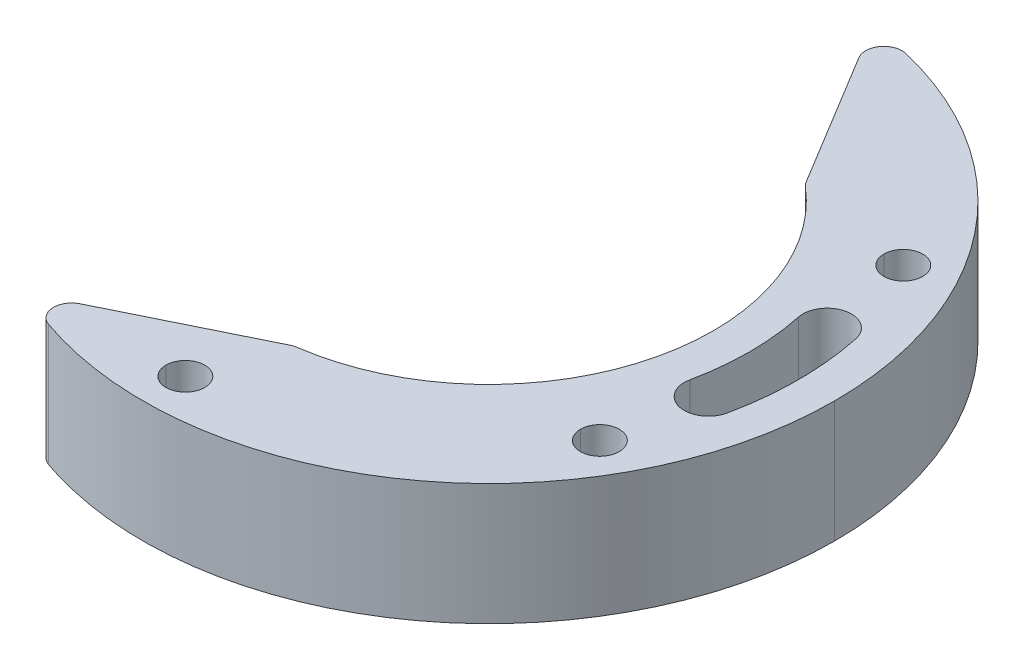
ISO-10303-21;
HEADER;
FILE_DESCRIPTION(('STEP AP214'),'2;1');
FILE_NAME('part.step','',(''),(''),'','','');
FILE_SCHEMA(('AUTOMOTIVE_DESIGN { 1 0 10303 214 1 1 1 1 }'));
ENDSEC;
DATA;
#1=APPLICATION_CONTEXT('core data for automotive mechanical design processes');
#2=APPLICATION_PROTOCOL_DEFINITION('international standard','automotive_design',2000,#1);
#3=PRODUCT_CONTEXT('',#1,'mechanical');
#4=PRODUCT('Part','Part','',(#3));
#5=PRODUCT_RELATED_PRODUCT_CATEGORY('part','',(#4));
#6=PRODUCT_DEFINITION_FORMATION('','',#4);
#7=PRODUCT_DEFINITION_CONTEXT('part definition',#1,'design');
#8=PRODUCT_DEFINITION('design','',#6,#7);
#9=PRODUCT_DEFINITION_SHAPE('','',#8);
#10=(LENGTH_UNIT() NAMED_UNIT(*) SI_UNIT(.MILLI.,.METRE.));
#11=(NAMED_UNIT(*) PLANE_ANGLE_UNIT() SI_UNIT($,.RADIAN.));
#12=(NAMED_UNIT(*) SI_UNIT($,.STERADIAN.) SOLID_ANGLE_UNIT());
#13=UNCERTAINTY_MEASURE_WITH_UNIT(LENGTH_MEASURE(1.E-05),#10,'distance_accuracy_value','');
#14=(GEOMETRIC_REPRESENTATION_CONTEXT(3) GLOBAL_UNCERTAINTY_ASSIGNED_CONTEXT((#13)) GLOBAL_UNIT_ASSIGNED_CONTEXT((#10,
#11,#12)) REPRESENTATION_CONTEXT('',''));
#15=CARTESIAN_POINT('',(0.,0.,0.));
#16=DIRECTION('',(0.,0.,1.));
#17=DIRECTION('',(1.,0.,0.));
#18=AXIS2_PLACEMENT_3D('',#15,#16,#17);
#19=CARTESIAN_POINT('',(0.,-5.,0.));
#20=DIRECTION('',(0.,-1.,0.));
#21=DIRECTION('',(1.,0.,0.));
#22=AXIS2_PLACEMENT_3D('',#19,#20,#21);
#23=PLANE('',#22);
#24=CARTESIAN_POINT('',(22.9864686172444,-4.99999999999991,-4.88592473421735));
#25=DIRECTION('',(0.,-1.,0.));
#26=DIRECTION('',(0.,0.,-1.));
#27=AXIS2_PLACEMENT_3D('',#24,#25,#26);
#28=CIRCLE('',#27,2.);
#29=CARTESIAN_POINT('',(21.0301734157768,-5.,-4.47010135258184));
#30=VERTEX_POINT('',#29);
#31=CARTESIAN_POINT('',(24.942763818712,-5.,-5.30174811585288));
#32=VERTEX_POINT('',#31);
#33=EDGE_CURVE('E229',#30,#32,#28,.T.);
#34=ORIENTED_EDGE('',*,*,#33,.F.);
#35=CARTESIAN_POINT('',(0.,-5.,0.));
#36=DIRECTION('',(0.,-1.,0.));
#37=DIRECTION('',(0.,0.,-1.));
#38=AXIS2_PLACEMENT_3D('',#35,#36,#37);
#39=CIRCLE('',#38,21.5);
#40=CARTESIAN_POINT('',(21.0301734157768,-5.,4.47010135258184));
#41=VERTEX_POINT('',#40);
#42=EDGE_CURVE('E233',#30,#41,#39,.T.);
#43=ORIENTED_EDGE('',*,*,#42,.T.);
#44=CARTESIAN_POINT('',(22.9864686172444,-5.,4.88592473421736));
#45=DIRECTION('',(0.,-1.,0.));
#46=DIRECTION('',(0.,0.,-1.));
#47=AXIS2_PLACEMENT_3D('',#44,#45,#46);
#48=CIRCLE('',#47,2.);
#49=CARTESIAN_POINT('',(24.942763818712,-4.99999999999991,5.30174811585287));
#50=VERTEX_POINT('',#49);
#51=EDGE_CURVE('E236',#50,#41,#48,.T.);
#52=ORIENTED_EDGE('',*,*,#51,.F.);
#53=CARTESIAN_POINT('',(0.,-5.,0.));
#54=DIRECTION('',(0.,-1.,0.));
#55=DIRECTION('',(0.,0.,-1.));
#56=AXIS2_PLACEMENT_3D('',#53,#54,#55);
#57=CIRCLE('',#56,25.5);
#58=EDGE_CURVE('E240',#32,#50,#57,.T.);
#59=ORIENTED_EDGE('',*,*,#58,.F.);
#60=EDGE_LOOP('',(#34,#43,#52,#59));
#61=FACE_BOUND('',#60,.T.);
#62=CARTESIAN_POINT('',(21.650635094611,-5.,-12.5));
#63=DIRECTION('',(0.,1.,0.));
#64=DIRECTION('',(-1.,0.,0.));
#65=AXIS2_PLACEMENT_3D('',#62,#63,#64);
#66=CIRCLE('',#65,2.75);
#67=CARTESIAN_POINT('',(18.900635094611,-4.99999999999999,-12.5));
#68=VERTEX_POINT('',#67);
#69=CARTESIAN_POINT('',(24.400635094611,-5.,-12.5));
#70=VERTEX_POINT('',#69);
#71=EDGE_CURVE('E349',#68,#70,#66,.T.);
#72=ORIENTED_EDGE('',*,*,#71,.T.);
#73=CARTESIAN_POINT('',(21.650635094611,-5.,-12.5));
#74=DIRECTION('',(0.,1.,0.));
#75=DIRECTION('',(1.,0.,0.));
#76=AXIS2_PLACEMENT_3D('',#73,#74,#75);
#77=CIRCLE('',#76,2.75);
#78=EDGE_CURVE('E346',#70,#68,#77,.T.);
#79=ORIENTED_EDGE('',*,*,#78,.T.);
#80=EDGE_LOOP('',(#72,#79));
#81=FACE_BOUND('',#80,.T.);
#82=CARTESIAN_POINT('',(21.650635094611,-5.,12.5));
#83=DIRECTION('',(0.,1.,0.));
#84=DIRECTION('',(-1.,0.,0.));
#85=AXIS2_PLACEMENT_3D('',#82,#83,#84);
#86=CIRCLE('',#85,2.75);
#87=CARTESIAN_POINT('',(18.900635094611,-5.00000000000001,12.5));
#88=VERTEX_POINT('',#87);
#89=CARTESIAN_POINT('',(24.400635094611,-5.,12.5));
#90=VERTEX_POINT('',#89);
#91=EDGE_CURVE('E343',#88,#90,#86,.T.);
#92=ORIENTED_EDGE('',*,*,#91,.T.);
#93=CARTESIAN_POINT('',(21.650635094611,-5.,12.5));
#94=DIRECTION('',(0.,1.,0.));
#95=DIRECTION('',(1.,0.,0.));
#96=AXIS2_PLACEMENT_3D('',#93,#94,#95);
#97=CIRCLE('',#96,2.75);
#98=EDGE_CURVE('E340',#90,#88,#97,.T.);
#99=ORIENTED_EDGE('',*,*,#98,.T.);
#100=EDGE_LOOP('',(#92,#99));
#101=FACE_BOUND('',#100,.T.);
#102=CARTESIAN_POINT('',(0.,-5.,25.));
#103=DIRECTION('',(0.,1.,0.));
#104=DIRECTION('',(-1.,0.,0.));
#105=AXIS2_PLACEMENT_3D('',#102,#103,#104);
#106=CIRCLE('',#105,2.75);
#107=CARTESIAN_POINT('',(-2.75,-5.,25.));
#108=VERTEX_POINT('',#107);
#109=CARTESIAN_POINT('',(2.75000000000001,-5.,25.));
#110=VERTEX_POINT('',#109);
#111=EDGE_CURVE('E337',#108,#110,#106,.T.);
#112=ORIENTED_EDGE('',*,*,#111,.T.);
#113=CARTESIAN_POINT('',(0.,-5.,25.));
#114=DIRECTION('',(0.,1.,0.));
#115=DIRECTION('',(1.,0.,0.));
#116=AXIS2_PLACEMENT_3D('',#113,#114,#115);
#117=CIRCLE('',#116,2.75);
#118=EDGE_CURVE('E334',#110,#108,#117,.T.);
#119=ORIENTED_EDGE('',*,*,#118,.T.);
#120=EDGE_LOOP('',(#112,#119));
#121=FACE_BOUND('',#120,.T.);
#122=CARTESIAN_POINT('',(0.,-5.,0.));
#123=DIRECTION('',(0.,-1.,0.));
#124=DIRECTION('',(1.,0.,0.));
#125=AXIS2_PLACEMENT_3D('',#122,#123,#124);
#126=CIRCLE('',#125,28.5);
#127=CARTESIAN_POINT('',(28.5,-5.,0.));
#128=VERTEX_POINT('',#127);
#129=CARTESIAN_POINT('',(-6.64347695413615,-4.99999999999991,27.7148735151337));
#130=VERTEX_POINT('',#129);
#131=EDGE_CURVE('E331',#128,#130,#126,.T.);
#132=ORIENTED_EDGE('',*,*,#131,.T.);
#133=CARTESIAN_POINT('',(0.,-5.,0.));
#134=DIRECTION('',(0.,-1.,0.));
#135=DIRECTION('',(-0.233104454531094,0.,0.972451702285393));
#136=AXIS2_PLACEMENT_3D('',#133,#134,#135);
#137=CIRCLE('',#136,28.5);
#138=CARTESIAN_POINT('',(-9.34455007267333,-5.,26.9245126964129));
#139=VERTEX_POINT('',#138);
#140=EDGE_CURVE('E328',#130,#139,#137,.T.);
#141=ORIENTED_EDGE('',*,*,#140,.T.);
#142=CARTESIAN_POINT('',(-8.85273164779584,-5.00000000000001,25.5074330808122));
#143=DIRECTION('',(0.,-1.,0.));
#144=DIRECTION('',(-0.327878949918248,0.,0.944719743733825));
#145=AXIS2_PLACEMENT_3D('',#142,#143,#144);
#146=CIRCLE('',#145,1.5);
#147=CARTESIAN_POINT('',(-9.51346314014746,-5.,24.1607950837934));
#148=VERTEX_POINT('',#147);
#149=EDGE_CURVE('E325',#139,#148,#146,.T.);
#150=ORIENTED_EDGE('',*,*,#149,.T.);
#151=DIRECTION('',(0.897758664679207,0.,-0.44048766156773));
#152=VECTOR('',#151,1.);
#153=CARTESIAN_POINT('',(-9.51346314014751,-5.,24.1607950837934));
#154=LINE('',#153,#152);
#155=CARTESIAN_POINT('',(2.10203301346869,-5.,18.4616211966958));
#156=VERTEX_POINT('',#155);
#157=EDGE_CURVE('E322',#148,#156,#154,.T.);
#158=ORIENTED_EDGE('',*,*,#157,.T.);
#159=CARTESIAN_POINT('',(2.76276450582039,-5.0000000000001,19.8082591937146));
#160=DIRECTION('',(0.,-1.,0.));
#161=DIRECTION('',(-0.440487661567936,0.,-0.897758664679106));
#162=AXIS2_PLACEMENT_3D('',#159,#160,#161);
#163=CIRCLE('',#162,1.5);
#164=CARTESIAN_POINT('',(2.55555716788384,-5.,18.322639754186));
#165=VERTEX_POINT('',#164);
#166=EDGE_CURVE('E319',#156,#165,#163,.T.);
#167=ORIENTED_EDGE('',*,*,#166,.T.);
#168=CARTESIAN_POINT('',(0.,-5.,0.));
#169=DIRECTION('',(0.,1.,0.));
#170=DIRECTION('',(0.138138225291018,0.,0.99041295968573));
#171=AXIS2_PLACEMENT_3D('',#168,#169,#170);
#172=CIRCLE('',#171,18.5);
#173=CARTESIAN_POINT('',(18.5,-5.,0.));
#174=VERTEX_POINT('',#173);
#175=EDGE_CURVE('E316',#165,#174,#172,.T.);
#176=ORIENTED_EDGE('',*,*,#175,.T.);
#177=CARTESIAN_POINT('',(0.,-5.,0.));
#178=DIRECTION('',(0.,1.,0.));
#179=DIRECTION('',(1.,0.,0.));
#180=AXIS2_PLACEMENT_3D('',#177,#178,#179);
#181=CIRCLE('',#180,18.5);
#182=CARTESIAN_POINT('',(12.0295450818391,-5.,-14.0548939919161));
#183=VERTEX_POINT('',#182);
#184=EDGE_CURVE('E313',#174,#183,#181,.T.);
#185=ORIENTED_EDGE('',*,*,#184,.T.);
#186=CARTESIAN_POINT('',(13.0049136019881,-5.,-15.1944799912608));
#187=DIRECTION('',(0.,-1.,0.));
#188=DIRECTION('',(-0.650245680099214,0.,0.759723999563204));
#189=AXIS2_PLACEMENT_3D('',#186,#187,#188);
#190=CIRCLE('',#189,1.5);
#191=CARTESIAN_POINT('',(11.722477893601,-5.,-14.4164320146851));
#192=VERTEX_POINT('',#191);
#193=EDGE_CURVE('E310',#183,#192,#190,.T.);
#194=ORIENTED_EDGE('',*,*,#193,.T.);
#195=DIRECTION('',(-0.518698651050486,0.,-0.854957138924756));
#196=VECTOR('',#195,1.);
#197=CARTESIAN_POINT('',(11.7224778936009,-5.,-14.4164320146851));
#198=LINE('',#197,#196);
#199=CARTESIAN_POINT('',(5.01138456395243,-5.,-25.4781479851299));
#200=VERTEX_POINT('',#199);
#201=EDGE_CURVE('E304',#192,#200,#198,.T.);
#202=ORIENTED_EDGE('',*,*,#201,.T.);
#203=CARTESIAN_POINT('',(6.29382027233955,-5.,-26.2561959617056));
#204=DIRECTION('',(0.,-1.,0.));
#205=DIRECTION('',(-0.854957138924763,0.,0.518698651050473));
#206=AXIS2_PLACEMENT_3D('',#203,#204,#205);
#207=CIRCLE('',#206,1.5);
#208=CARTESIAN_POINT('',(6.64347695413626,-5.,-27.7148735151337));
#209=VERTEX_POINT('',#208);
#210=EDGE_CURVE('E257',#200,#209,#207,.T.);
#211=ORIENTED_EDGE('',*,*,#210,.T.);
#212=CARTESIAN_POINT('',(0.,-5.,0.));
#213=DIRECTION('',(0.,-1.,0.));
#214=DIRECTION('',(0.233104454531102,0.,-0.97245170228539));
#215=AXIS2_PLACEMENT_3D('',#212,#213,#214);
#216=CIRCLE('',#215,28.5);
#217=EDGE_CURVE('E266',#209,#128,#216,.T.);
#218=ORIENTED_EDGE('',*,*,#217,.T.);
#219=EDGE_LOOP('',(#132,#141,#150,#158,#167,#176,#185,#194,#202,#211,#218));
#220=FACE_BOUND('',#219,.T.);
#221=ADVANCED_FACE('F39',(#61,#81,#101,#121,#220),#23,.T.);
#222=CARTESIAN_POINT('',(0.,5.,0.));
#223=DIRECTION('',(0.,-1.,0.));
#224=DIRECTION('',(1.,0.,0.));
#225=AXIS2_PLACEMENT_3D('',#222,#223,#224);
#226=PLANE('',#225);
#227=CARTESIAN_POINT('',(13.0049136019881,5.,-15.1944799912608));
#228=DIRECTION('',(0.,1.,0.));
#229=DIRECTION('',(-0.854957138924803,0.,0.518698651050411));
#230=AXIS2_PLACEMENT_3D('',#227,#228,#229);
#231=CIRCLE('',#230,1.5);
#232=CARTESIAN_POINT('',(11.722477893601,5.,-14.4164320146851));
#233=VERTEX_POINT('',#232);
#234=CARTESIAN_POINT('',(12.0295450818391,5.,-14.0548939919162));
#235=VERTEX_POINT('',#234);
#236=EDGE_CURVE('E283',#233,#235,#231,.T.);
#237=ORIENTED_EDGE('',*,*,#236,.T.);
#238=CARTESIAN_POINT('',(0.,5.,0.));
#239=DIRECTION('',(0.,-1.,0.));
#240=DIRECTION('',(0.650245680099414,0.,-0.759723999563031));
#241=AXIS2_PLACEMENT_3D('',#238,#239,#240);
#242=CIRCLE('',#241,18.5);
#243=CARTESIAN_POINT('',(18.5,5.,0.));
#244=VERTEX_POINT('',#243);
#245=EDGE_CURVE('E280',#235,#244,#242,.T.);
#246=ORIENTED_EDGE('',*,*,#245,.T.);
#247=CARTESIAN_POINT('',(0.,5.,0.));
#248=DIRECTION('',(0.,-1.,0.));
#249=DIRECTION('',(1.,0.,0.));
#250=AXIS2_PLACEMENT_3D('',#247,#248,#249);
#251=CIRCLE('',#250,18.5);
#252=CARTESIAN_POINT('',(2.55555716788388,5.,18.322639754186));
#253=VERTEX_POINT('',#252);
#254=EDGE_CURVE('E277',#244,#253,#251,.T.);
#255=ORIENTED_EDGE('',*,*,#254,.T.);
#256=CARTESIAN_POINT('',(2.76276450582038,4.99999999999989,19.8082591937146));
#257=DIRECTION('',(0.,1.,0.));
#258=DIRECTION('',(-0.138138225290984,0.,-0.990412959685733));
#259=AXIS2_PLACEMENT_3D('',#256,#257,#258);
#260=CIRCLE('',#259,1.5);
#261=CARTESIAN_POINT('',(2.10203301346867,5.,18.4616211966958));
#262=VERTEX_POINT('',#261);
#263=EDGE_CURVE('E274',#253,#262,#260,.T.);
#264=ORIENTED_EDGE('',*,*,#263,.T.);
#265=DIRECTION('',(-0.897758664679207,0.,0.44048766156773));
#266=VECTOR('',#265,1.);
#267=CARTESIAN_POINT('',(2.10203301346844,5.,18.4616211966959));
#268=LINE('',#267,#266);
#269=CARTESIAN_POINT('',(-9.51346314014746,5.,24.1607950837934));
#270=VERTEX_POINT('',#269);
#271=EDGE_CURVE('E271',#262,#270,#268,.T.);
#272=ORIENTED_EDGE('',*,*,#271,.T.);
#273=CARTESIAN_POINT('',(-8.85273164779583,5.,25.5074330808122));
#274=DIRECTION('',(0.,1.,0.));
#275=DIRECTION('',(-0.440487661567778,0.,-0.897758664679182));
#276=AXIS2_PLACEMENT_3D('',#273,#274,#275);
#277=CIRCLE('',#276,1.5);
#278=CARTESIAN_POINT('',(-9.34455007267333,5.,26.9245126964129));
#279=VERTEX_POINT('',#278);
#280=EDGE_CURVE('E268',#270,#279,#277,.T.);
#281=ORIENTED_EDGE('',*,*,#280,.T.);
#282=CARTESIAN_POINT('',(0.,5.,0.));
#283=DIRECTION('',(0.,1.,0.));
#284=DIRECTION('',(-0.327878949918359,0.,0.944719743733787));
#285=AXIS2_PLACEMENT_3D('',#282,#283,#284);
#286=CIRCLE('',#285,28.5);
#287=CARTESIAN_POINT('',(28.5,5.,0.));
#288=VERTEX_POINT('',#287);
#289=EDGE_CURVE('E62',#279,#288,#286,.T.);
#290=ORIENTED_EDGE('',*,*,#289,.T.);
#291=CARTESIAN_POINT('',(0.,5.,0.));
#292=DIRECTION('',(0.,1.,0.));
#293=DIRECTION('',(1.,0.,0.));
#294=AXIS2_PLACEMENT_3D('',#291,#292,#293);
#295=CIRCLE('',#294,28.5);
#296=CARTESIAN_POINT('',(6.64347695413627,5.,-27.7148735151336));
#297=VERTEX_POINT('',#296);
#298=EDGE_CURVE('E264',#288,#297,#295,.T.);
#299=ORIENTED_EDGE('',*,*,#298,.T.);
#300=CARTESIAN_POINT('',(6.29382027233955,4.99999999999999,-26.2561959617056));
#301=DIRECTION('',(0.,1.,0.));
#302=DIRECTION('',(0.233104454531234,0.,-0.97245170228536));
#303=AXIS2_PLACEMENT_3D('',#300,#301,#302);
#304=CIRCLE('',#303,1.5);
#305=CARTESIAN_POINT('',(5.01138456395241,5.00000000000001,-25.4781479851299));
#306=VERTEX_POINT('',#305);
#307=EDGE_CURVE('E253',#297,#306,#304,.T.);
#308=ORIENTED_EDGE('',*,*,#307,.T.);
#309=DIRECTION('',(0.518698651050486,0.,0.854957138924756));
#310=VECTOR('',#309,1.);
#311=CARTESIAN_POINT('',(5.01138456395243,5.00000000000001,-25.4781479851298));
#312=LINE('',#311,#310);
#313=EDGE_CURVE('E258',#306,#233,#312,.T.);
#314=ORIENTED_EDGE('',*,*,#313,.T.);
#315=EDGE_LOOP('',(#237,#246,#255,#264,#272,#281,#290,#299,#308,#314));
#316=FACE_BOUND('',#315,.T.);
#317=CARTESIAN_POINT('',(21.650635094611,5.,-12.5));
#318=DIRECTION('',(0.,-1.,0.));
#319=DIRECTION('',(1.,0.,0.));
#320=AXIS2_PLACEMENT_3D('',#317,#318,#319);
#321=CIRCLE('',#320,1.6);
#322=CARTESIAN_POINT('',(23.250635094611,5.,-12.5));
#323=VERTEX_POINT('',#322);
#324=CARTESIAN_POINT('',(20.050635094611,5.,-12.5));
#325=VERTEX_POINT('',#324);
#326=EDGE_CURVE('E289',#323,#325,#321,.T.);
#327=ORIENTED_EDGE('',*,*,#326,.T.);
#328=CARTESIAN_POINT('',(21.650635094611,5.,-12.5));
#329=DIRECTION('',(0.,-1.,0.));
#330=DIRECTION('',(-1.,0.,0.));
#331=AXIS2_PLACEMENT_3D('',#328,#329,#330);
#332=CIRCLE('',#331,1.6);
#333=EDGE_CURVE('E286',#325,#323,#332,.T.);
#334=ORIENTED_EDGE('',*,*,#333,.T.);
#335=EDGE_LOOP('',(#327,#334));
#336=FACE_BOUND('',#335,.T.);
#337=CARTESIAN_POINT('',(21.650635094611,5.,12.5));
#338=DIRECTION('',(0.,-1.,0.));
#339=DIRECTION('',(1.,0.,0.));
#340=AXIS2_PLACEMENT_3D('',#337,#338,#339);
#341=CIRCLE('',#340,1.6);
#342=CARTESIAN_POINT('',(23.250635094611,5.0000000000001,12.5));
#343=VERTEX_POINT('',#342);
#344=CARTESIAN_POINT('',(20.050635094611,5.,12.5));
#345=VERTEX_POINT('',#344);
#346=EDGE_CURVE('E295',#343,#345,#341,.T.);
#347=ORIENTED_EDGE('',*,*,#346,.T.);
#348=CARTESIAN_POINT('',(21.650635094611,5.,12.5));
#349=DIRECTION('',(0.,-1.,0.));
#350=DIRECTION('',(-1.,0.,0.));
#351=AXIS2_PLACEMENT_3D('',#348,#349,#350);
#352=CIRCLE('',#351,1.6);
#353=EDGE_CURVE('E292',#345,#343,#352,.T.);
#354=ORIENTED_EDGE('',*,*,#353,.T.);
#355=EDGE_LOOP('',(#347,#354));
#356=FACE_BOUND('',#355,.T.);
#357=CARTESIAN_POINT('',(0.,5.,25.));
#358=DIRECTION('',(0.,-1.,0.));
#359=DIRECTION('',(1.,0.,0.));
#360=AXIS2_PLACEMENT_3D('',#357,#358,#359);
#361=CIRCLE('',#360,1.6);
#362=CARTESIAN_POINT('',(1.6,5.0000000000001,25.));
#363=VERTEX_POINT('',#362);
#364=CARTESIAN_POINT('',(-1.6,5.,25.));
#365=VERTEX_POINT('',#364);
#366=EDGE_CURVE('E301',#363,#365,#361,.T.);
#367=ORIENTED_EDGE('',*,*,#366,.T.);
#368=CARTESIAN_POINT('',(0.,5.,25.));
#369=DIRECTION('',(0.,-1.,0.));
#370=DIRECTION('',(-1.,0.,0.));
#371=AXIS2_PLACEMENT_3D('',#368,#369,#370);
#372=CIRCLE('',#371,1.6);
#373=EDGE_CURVE('E298',#365,#363,#372,.T.);
#374=ORIENTED_EDGE('',*,*,#373,.T.);
#375=EDGE_LOOP('',(#367,#374));
#376=FACE_BOUND('',#375,.T.);
#377=CARTESIAN_POINT('',(0.,5.,0.));
#378=DIRECTION('',(0.,-1.,0.));
#379=DIRECTION('',(0.,0.,-1.));
#380=AXIS2_PLACEMENT_3D('',#377,#378,#379);
#381=CIRCLE('',#380,21.5);
#382=CARTESIAN_POINT('',(21.0301734157768,5.,-4.47010135258183));
#383=VERTEX_POINT('',#382);
#384=CARTESIAN_POINT('',(21.0301734157768,5.,4.47010135258184));
#385=VERTEX_POINT('',#384);
#386=EDGE_CURVE('E11',#383,#385,#381,.T.);
#387=ORIENTED_EDGE('',*,*,#386,.F.);
#388=CARTESIAN_POINT('',(22.9864686172444,5.0000000000001,-4.88592473421737));
#389=DIRECTION('',(0.,-1.,0.));
#390=DIRECTION('',(0.,0.,-1.));
#391=AXIS2_PLACEMENT_3D('',#388,#389,#390);
#392=CIRCLE('',#391,2.);
#393=CARTESIAN_POINT('',(24.942763818712,5.,-5.30174811585287));
#394=VERTEX_POINT('',#393);
#395=EDGE_CURVE('E227',#383,#394,#392,.T.);
#396=ORIENTED_EDGE('',*,*,#395,.T.);
#397=CARTESIAN_POINT('',(0.,5.,0.));
#398=DIRECTION('',(0.,-1.,0.));
#399=DIRECTION('',(0.,0.,-1.));
#400=AXIS2_PLACEMENT_3D('',#397,#398,#399);
#401=CIRCLE('',#400,25.5);
#402=CARTESIAN_POINT('',(24.942763818712,5.0000000000001,5.30174811585287));
#403=VERTEX_POINT('',#402);
#404=EDGE_CURVE('E47',#394,#403,#401,.T.);
#405=ORIENTED_EDGE('',*,*,#404,.T.);
#406=CARTESIAN_POINT('',(22.9864686172444,5.,4.88592473421735));
#407=DIRECTION('',(0.,-1.,0.));
#408=DIRECTION('',(0.,0.,-1.));
#409=AXIS2_PLACEMENT_3D('',#406,#407,#408);
#410=CIRCLE('',#409,2.);
#411=EDGE_CURVE('E54',#403,#385,#410,.T.);
#412=ORIENTED_EDGE('',*,*,#411,.T.);
#413=EDGE_LOOP('',(#387,#396,#405,#412));
#414=FACE_BOUND('',#413,.T.);
#415=ADVANCED_FACE('F231',(#316,#336,#356,#376,#414),#226,.F.);
#416=CARTESIAN_POINT('',(21.650635094611,-5.,-12.5));
#417=DIRECTION('',(0.,-1.,0.));
#418=DIRECTION('',(1.,0.,0.));
#419=AXIS2_PLACEMENT_3D('',#416,#417,#418);
#420=CYLINDRICAL_SURFACE('',#419,1.6);
#421=ORIENTED_EDGE('',*,*,#326,.F.);
#422=DIRECTION('',(0.,-1.,0.));
#423=VECTOR('',#422,1.);
#424=CARTESIAN_POINT('',(23.250635094611,5.,-12.5));
#425=LINE('',#424,#423);
#426=CARTESIAN_POINT('',(23.250635094611,-2.,-12.5));
#427=VERTEX_POINT('',#426);
#428=EDGE_CURVE('E423',#323,#427,#425,.T.);
#429=ORIENTED_EDGE('',*,*,#428,.T.);
#430=CARTESIAN_POINT('',(21.650635094611,-2.,-12.5));
#431=DIRECTION('',(0.,1.,0.));
#432=DIRECTION('',(-1.,0.,0.));
#433=AXIS2_PLACEMENT_3D('',#430,#431,#432);
#434=CIRCLE('',#433,1.6);
#435=CARTESIAN_POINT('',(20.050635094611,-2.,-12.5));
#436=VERTEX_POINT('',#435);
#437=EDGE_CURVE('E420',#436,#427,#434,.T.);
#438=ORIENTED_EDGE('',*,*,#437,.F.);
#439=DIRECTION('',(0.,-1.,0.));
#440=VECTOR('',#439,1.);
#441=CARTESIAN_POINT('',(20.050635094611,5.,-12.5));
#442=LINE('',#441,#440);
#443=EDGE_CURVE('E223',#325,#436,#442,.T.);
#444=ORIENTED_EDGE('',*,*,#443,.F.);
#445=EDGE_LOOP('',(#421,#429,#438,#444));
#446=FACE_BOUND('',#445,.T.);
#447=ADVANCED_FACE('F41',(#446),#420,.F.);
#448=CARTESIAN_POINT('',(21.650635094611,-5.,-12.5));
#449=DIRECTION('',(0.,-1.,0.));
#450=DIRECTION('',(1.,0.,0.));
#451=AXIS2_PLACEMENT_3D('',#448,#449,#450);
#452=CYLINDRICAL_SURFACE('',#451,1.6);
#453=ORIENTED_EDGE('',*,*,#333,.F.);
#454=ORIENTED_EDGE('',*,*,#443,.T.);
#455=CARTESIAN_POINT('',(21.650635094611,-2.,-12.5));
#456=DIRECTION('',(0.,1.,0.));
#457=DIRECTION('',(1.,0.,0.));
#458=AXIS2_PLACEMENT_3D('',#455,#456,#457);
#459=CIRCLE('',#458,1.6);
#460=EDGE_CURVE('E417',#427,#436,#459,.T.);
#461=ORIENTED_EDGE('',*,*,#460,.F.);
#462=ORIENTED_EDGE('',*,*,#428,.F.);
#463=EDGE_LOOP('',(#453,#454,#461,#462));
#464=FACE_BOUND('',#463,.T.);
#465=ADVANCED_FACE('F431',(#464),#452,.F.);
#466=CARTESIAN_POINT('',(0.,-2.,0.));
#467=DIRECTION('',(0.,-1.,0.));
#468=DIRECTION('',(1.,0.,0.));
#469=AXIS2_PLACEMENT_3D('',#466,#467,#468);
#470=PLANE('',#469);
#471=ORIENTED_EDGE('',*,*,#437,.T.);
#472=ORIENTED_EDGE('',*,*,#460,.T.);
#473=EDGE_LOOP('',(#471,#472));
#474=FACE_BOUND('',#473,.T.);
#475=CARTESIAN_POINT('',(21.650635094611,-2.,-12.5));
#476=DIRECTION('',(0.,-1.,0.));
#477=DIRECTION('',(1.,0.,0.));
#478=AXIS2_PLACEMENT_3D('',#475,#476,#477);
#479=CIRCLE('',#478,2.75);
#480=CARTESIAN_POINT('',(24.400635094611,-1.99999999999999,-12.5));
#481=VERTEX_POINT('',#480);
#482=CARTESIAN_POINT('',(18.900635094611,-1.99999999999999,-12.5));
#483=VERTEX_POINT('',#482);
#484=EDGE_CURVE('E415',#481,#483,#479,.T.);
#485=ORIENTED_EDGE('',*,*,#484,.T.);
#486=CARTESIAN_POINT('',(21.650635094611,-2.,-12.5));
#487=DIRECTION('',(0.,-1.,0.));
#488=DIRECTION('',(-1.,0.,0.));
#489=AXIS2_PLACEMENT_3D('',#486,#487,#488);
#490=CIRCLE('',#489,2.75);
#491=EDGE_CURVE('E412',#483,#481,#490,.T.);
#492=ORIENTED_EDGE('',*,*,#491,.T.);
#493=EDGE_LOOP('',(#485,#492));
#494=FACE_BOUND('',#493,.T.);
#495=ADVANCED_FACE('F433',(#474,#494),#470,.T.);
#496=CARTESIAN_POINT('',(21.650635094611,-5.,-12.5));
#497=DIRECTION('',(0.,-1.,0.));
#498=DIRECTION('',(1.,0.,0.));
#499=AXIS2_PLACEMENT_3D('',#496,#497,#498);
#500=CYLINDRICAL_SURFACE('',#499,2.75);
#501=ORIENTED_EDGE('',*,*,#484,.F.);
#502=DIRECTION('',(0.,-1.,0.));
#503=VECTOR('',#502,1.);
#504=CARTESIAN_POINT('',(24.400635094611,-1.99999999999999,-12.5));
#505=LINE('',#504,#503);
#506=EDGE_CURVE('E407',#481,#70,#505,.T.);
#507=ORIENTED_EDGE('',*,*,#506,.T.);
#508=ORIENTED_EDGE('',*,*,#71,.F.);
#509=DIRECTION('',(0.,-1.,0.));
#510=VECTOR('',#509,1.);
#511=CARTESIAN_POINT('',(18.900635094611,-1.99999999999999,-12.5));
#512=LINE('',#511,#510);
#513=EDGE_CURVE('E409',#483,#68,#512,.T.);
#514=ORIENTED_EDGE('',*,*,#513,.F.);
#515=EDGE_LOOP('',(#501,#507,#508,#514));
#516=FACE_BOUND('',#515,.T.);
#517=ADVANCED_FACE('F436',(#516),#500,.F.);
#518=CARTESIAN_POINT('',(21.650635094611,-5.,-12.5));
#519=DIRECTION('',(0.,-1.,0.));
#520=DIRECTION('',(1.,0.,0.));
#521=AXIS2_PLACEMENT_3D('',#518,#519,#520);
#522=CYLINDRICAL_SURFACE('',#521,2.75);
#523=ORIENTED_EDGE('',*,*,#491,.F.);
#524=ORIENTED_EDGE('',*,*,#513,.T.);
#525=ORIENTED_EDGE('',*,*,#78,.F.);
#526=ORIENTED_EDGE('',*,*,#506,.F.);
#527=EDGE_LOOP('',(#523,#524,#525,#526));
#528=FACE_BOUND('',#527,.T.);
#529=ADVANCED_FACE('F445',(#528),#522,.F.);
#530=CARTESIAN_POINT('',(21.650635094611,-5.,12.5));
#531=DIRECTION('',(0.,-1.,0.));
#532=DIRECTION('',(1.,0.,0.));
#533=AXIS2_PLACEMENT_3D('',#530,#531,#532);
#534=CYLINDRICAL_SURFACE('',#533,1.6);
#535=ORIENTED_EDGE('',*,*,#346,.F.);
#536=DIRECTION('',(0.,-1.,0.));
#537=VECTOR('',#536,1.);
#538=CARTESIAN_POINT('',(23.250635094611,5.0000000000001,12.5));
#539=LINE('',#538,#537);
#540=CARTESIAN_POINT('',(23.250635094611,-1.9999999999999,12.5));
#541=VERTEX_POINT('',#540);
#542=EDGE_CURVE('E403',#343,#541,#539,.T.);
#543=ORIENTED_EDGE('',*,*,#542,.T.);
#544=CARTESIAN_POINT('',(21.650635094611,-2.,12.5));
#545=DIRECTION('',(0.,1.,0.));
#546=DIRECTION('',(-1.,0.,0.));
#547=AXIS2_PLACEMENT_3D('',#544,#545,#546);
#548=CIRCLE('',#547,1.6);
#549=CARTESIAN_POINT('',(20.050635094611,-2.,12.5));
#550=VERTEX_POINT('',#549);
#551=EDGE_CURVE('E400',#550,#541,#548,.T.);
#552=ORIENTED_EDGE('',*,*,#551,.F.);
#553=DIRECTION('',(0.,-1.,0.));
#554=VECTOR('',#553,1.);
#555=CARTESIAN_POINT('',(20.050635094611,5.,12.5));
#556=LINE('',#555,#554);
#557=EDGE_CURVE('E404',#345,#550,#556,.T.);
#558=ORIENTED_EDGE('',*,*,#557,.F.);
#559=EDGE_LOOP('',(#535,#543,#552,#558));
#560=FACE_BOUND('',#559,.T.);
#561=ADVANCED_FACE('F554',(#560),#534,.F.);
#562=CARTESIAN_POINT('',(21.650635094611,-5.,12.5));
#563=DIRECTION('',(0.,-1.,0.));
#564=DIRECTION('',(1.,0.,0.));
#565=AXIS2_PLACEMENT_3D('',#562,#563,#564);
#566=CYLINDRICAL_SURFACE('',#565,1.6);
#567=ORIENTED_EDGE('',*,*,#353,.F.);
#568=ORIENTED_EDGE('',*,*,#557,.T.);
#569=CARTESIAN_POINT('',(21.650635094611,-2.,12.5));
#570=DIRECTION('',(0.,1.,0.));
#571=DIRECTION('',(1.,0.,0.));
#572=AXIS2_PLACEMENT_3D('',#569,#570,#571);
#573=CIRCLE('',#572,1.6);
#574=EDGE_CURVE('E397',#541,#550,#573,.T.);
#575=ORIENTED_EDGE('',*,*,#574,.F.);
#576=ORIENTED_EDGE('',*,*,#542,.F.);
#577=EDGE_LOOP('',(#567,#568,#575,#576));
#578=FACE_BOUND('',#577,.T.);
#579=ADVANCED_FACE('F550',(#578),#566,.F.);
#580=CARTESIAN_POINT('',(0.,-2.,0.));
#581=DIRECTION('',(0.,-1.,0.));
#582=DIRECTION('',(1.,0.,0.));
#583=AXIS2_PLACEMENT_3D('',#580,#581,#582);
#584=PLANE('',#583);
#585=ORIENTED_EDGE('',*,*,#551,.T.);
#586=ORIENTED_EDGE('',*,*,#574,.T.);
#587=EDGE_LOOP('',(#585,#586));
#588=FACE_BOUND('',#587,.T.);
#589=CARTESIAN_POINT('',(21.650635094611,-2.,12.5));
#590=DIRECTION('',(0.,-1.,0.));
#591=DIRECTION('',(1.,0.,0.));
#592=AXIS2_PLACEMENT_3D('',#589,#590,#591);
#593=CIRCLE('',#592,2.75);
#594=CARTESIAN_POINT('',(24.400635094611,-1.99999999999999,12.5));
#595=VERTEX_POINT('',#594);
#596=CARTESIAN_POINT('',(18.900635094611,-2.00000000000001,12.5));
#597=VERTEX_POINT('',#596);
#598=EDGE_CURVE('E395',#595,#597,#593,.T.);
#599=ORIENTED_EDGE('',*,*,#598,.T.);
#600=CARTESIAN_POINT('',(21.650635094611,-2.,12.5));
#601=DIRECTION('',(0.,-1.,0.));
#602=DIRECTION('',(-1.,0.,0.));
#603=AXIS2_PLACEMENT_3D('',#600,#601,#602);
#604=CIRCLE('',#603,2.75);
#605=EDGE_CURVE('E392',#597,#595,#604,.T.);
#606=ORIENTED_EDGE('',*,*,#605,.T.);
#607=EDGE_LOOP('',(#599,#606));
#608=FACE_BOUND('',#607,.T.);
#609=ADVANCED_FACE('F546',(#588,#608),#584,.T.);
#610=CARTESIAN_POINT('',(21.650635094611,-5.,12.5));
#611=DIRECTION('',(0.,-1.,0.));
#612=DIRECTION('',(1.,0.,0.));
#613=AXIS2_PLACEMENT_3D('',#610,#611,#612);
#614=CYLINDRICAL_SURFACE('',#613,2.75);
#615=ORIENTED_EDGE('',*,*,#598,.F.);
#616=DIRECTION('',(0.,-1.,0.));
#617=VECTOR('',#616,1.);
#618=CARTESIAN_POINT('',(24.400635094611,-1.99999999999999,12.5));
#619=LINE('',#618,#617);
#620=EDGE_CURVE('E387',#595,#90,#619,.T.);
#621=ORIENTED_EDGE('',*,*,#620,.T.);
#622=ORIENTED_EDGE('',*,*,#91,.F.);
#623=DIRECTION('',(0.,-1.,0.));
#624=VECTOR('',#623,1.);
#625=CARTESIAN_POINT('',(18.900635094611,-2.00000000000001,12.5));
#626=LINE('',#625,#624);
#627=EDGE_CURVE('E389',#597,#88,#626,.T.);
#628=ORIENTED_EDGE('',*,*,#627,.F.);
#629=EDGE_LOOP('',(#615,#621,#622,#628));
#630=FACE_BOUND('',#629,.T.);
#631=ADVANCED_FACE('F542',(#630),#614,.F.);
#632=CARTESIAN_POINT('',(21.650635094611,-5.,12.5));
#633=DIRECTION('',(0.,-1.,0.));
#634=DIRECTION('',(1.,0.,0.));
#635=AXIS2_PLACEMENT_3D('',#632,#633,#634);
#636=CYLINDRICAL_SURFACE('',#635,2.75);
#637=ORIENTED_EDGE('',*,*,#605,.F.);
#638=ORIENTED_EDGE('',*,*,#627,.T.);
#639=ORIENTED_EDGE('',*,*,#98,.F.);
#640=ORIENTED_EDGE('',*,*,#620,.F.);
#641=EDGE_LOOP('',(#637,#638,#639,#640));
#642=FACE_BOUND('',#641,.T.);
#643=ADVANCED_FACE('F538',(#642),#636,.F.);
#644=CARTESIAN_POINT('',(0.,-5.,25.));
#645=DIRECTION('',(0.,-1.,0.));
#646=DIRECTION('',(1.,0.,0.));
#647=AXIS2_PLACEMENT_3D('',#644,#645,#646);
#648=CYLINDRICAL_SURFACE('',#647,1.6);
#649=ORIENTED_EDGE('',*,*,#366,.F.);
#650=DIRECTION('',(0.,-1.,0.));
#651=VECTOR('',#650,1.);
#652=CARTESIAN_POINT('',(1.6,5.0000000000001,25.));
#653=LINE('',#652,#651);
#654=CARTESIAN_POINT('',(1.60000000000005,-1.9999999999999,25.));
#655=VERTEX_POINT('',#654);
#656=EDGE_CURVE('E383',#363,#655,#653,.T.);
#657=ORIENTED_EDGE('',*,*,#656,.T.);
#658=CARTESIAN_POINT('',(0.,-2.,25.));
#659=DIRECTION('',(0.,1.,0.));
#660=DIRECTION('',(-1.,0.,0.));
#661=AXIS2_PLACEMENT_3D('',#658,#659,#660);
#662=CIRCLE('',#661,1.6);
#663=CARTESIAN_POINT('',(-1.59999999999998,-2.,25.));
#664=VERTEX_POINT('',#663);
#665=EDGE_CURVE('E380',#664,#655,#662,.T.);
#666=ORIENTED_EDGE('',*,*,#665,.F.);
#667=DIRECTION('',(0.,-1.,0.));
#668=VECTOR('',#667,1.);
#669=CARTESIAN_POINT('',(-1.6,5.,25.));
#670=LINE('',#669,#668);
#671=EDGE_CURVE('E384',#365,#664,#670,.T.);
#672=ORIENTED_EDGE('',*,*,#671,.F.);
#673=EDGE_LOOP('',(#649,#657,#666,#672));
#674=FACE_BOUND('',#673,.T.);
#675=ADVANCED_FACE('F534',(#674),#648,.F.);
#676=CARTESIAN_POINT('',(0.,-5.,25.));
#677=DIRECTION('',(0.,-1.,0.));
#678=DIRECTION('',(1.,0.,0.));
#679=AXIS2_PLACEMENT_3D('',#676,#677,#678);
#680=CYLINDRICAL_SURFACE('',#679,1.6);
#681=ORIENTED_EDGE('',*,*,#373,.F.);
#682=ORIENTED_EDGE('',*,*,#671,.T.);
#683=CARTESIAN_POINT('',(0.,-2.,25.));
#684=DIRECTION('',(0.,1.,0.));
#685=DIRECTION('',(1.,0.,0.));
#686=AXIS2_PLACEMENT_3D('',#683,#684,#685);
#687=CIRCLE('',#686,1.6);
#688=EDGE_CURVE('E377',#655,#664,#687,.T.);
#689=ORIENTED_EDGE('',*,*,#688,.F.);
#690=ORIENTED_EDGE('',*,*,#656,.F.);
#691=EDGE_LOOP('',(#681,#682,#689,#690));
#692=FACE_BOUND('',#691,.T.);
#693=ADVANCED_FACE('F530',(#692),#680,.F.);
#694=CARTESIAN_POINT('',(0.,-2.,0.));
#695=DIRECTION('',(0.,-1.,0.));
#696=DIRECTION('',(1.,0.,0.));
#697=AXIS2_PLACEMENT_3D('',#694,#695,#696);
#698=PLANE('',#697);
#699=ORIENTED_EDGE('',*,*,#665,.T.);
#700=ORIENTED_EDGE('',*,*,#688,.T.);
#701=EDGE_LOOP('',(#699,#700));
#702=FACE_BOUND('',#701,.T.);
#703=CARTESIAN_POINT('',(0.,-2.,25.));
#704=DIRECTION('',(0.,-1.,0.));
#705=DIRECTION('',(1.,0.,0.));
#706=AXIS2_PLACEMENT_3D('',#703,#704,#705);
#707=CIRCLE('',#706,2.75);
#708=CARTESIAN_POINT('',(2.75,-1.99999999999999,25.));
#709=VERTEX_POINT('',#708);
#710=CARTESIAN_POINT('',(-2.75,-2.,25.));
#711=VERTEX_POINT('',#710);
#712=EDGE_CURVE('E375',#709,#711,#707,.T.);
#713=ORIENTED_EDGE('',*,*,#712,.T.);
#714=CARTESIAN_POINT('',(0.,-2.,25.));
#715=DIRECTION('',(0.,-1.,0.));
#716=DIRECTION('',(-1.,0.,0.));
#717=AXIS2_PLACEMENT_3D('',#714,#715,#716);
#718=CIRCLE('',#717,2.75);
#719=EDGE_CURVE('E372',#711,#709,#718,.T.);
#720=ORIENTED_EDGE('',*,*,#719,.T.);
#721=EDGE_LOOP('',(#713,#720));
#722=FACE_BOUND('',#721,.T.);
#723=ADVANCED_FACE('F526',(#702,#722),#698,.T.);
#724=CARTESIAN_POINT('',(0.,-5.,25.));
#725=DIRECTION('',(0.,-1.,0.));
#726=DIRECTION('',(1.,0.,0.));
#727=AXIS2_PLACEMENT_3D('',#724,#725,#726);
#728=CYLINDRICAL_SURFACE('',#727,2.75);
#729=ORIENTED_EDGE('',*,*,#712,.F.);
#730=DIRECTION('',(0.,-1.,0.));
#731=VECTOR('',#730,1.);
#732=CARTESIAN_POINT('',(2.75,-1.99999999999999,25.));
#733=LINE('',#732,#731);
#734=EDGE_CURVE('E368',#709,#110,#733,.T.);
#735=ORIENTED_EDGE('',*,*,#734,.T.);
#736=ORIENTED_EDGE('',*,*,#111,.F.);
#737=DIRECTION('',(0.,-1.,0.));
#738=VECTOR('',#737,1.);
#739=CARTESIAN_POINT('',(-2.75,-2.,25.));
#740=LINE('',#739,#738);
#741=EDGE_CURVE('E369',#711,#108,#740,.T.);
#742=ORIENTED_EDGE('',*,*,#741,.F.);
#743=EDGE_LOOP('',(#729,#735,#736,#742));
#744=FACE_BOUND('',#743,.T.);
#745=ADVANCED_FACE('F522',(#744),#728,.F.);
#746=CARTESIAN_POINT('',(0.,-5.,25.));
#747=DIRECTION('',(0.,-1.,0.));
#748=DIRECTION('',(1.,0.,0.));
#749=AXIS2_PLACEMENT_3D('',#746,#747,#748);
#750=CYLINDRICAL_SURFACE('',#749,2.75);
#751=ORIENTED_EDGE('',*,*,#719,.F.);
#752=ORIENTED_EDGE('',*,*,#741,.T.);
#753=ORIENTED_EDGE('',*,*,#118,.F.);
#754=ORIENTED_EDGE('',*,*,#734,.F.);
#755=EDGE_LOOP('',(#751,#752,#753,#754));
#756=FACE_BOUND('',#755,.T.);
#757=ADVANCED_FACE('F519',(#756),#750,.F.);
#758=CARTESIAN_POINT('',(0.,5.,0.));
#759=DIRECTION('',(0.,-1.,0.));
#760=DIRECTION('',(1.,0.,0.));
#761=AXIS2_PLACEMENT_3D('',#758,#759,#760);
#762=CYLINDRICAL_SURFACE('',#761,28.5);
#763=ORIENTED_EDGE('',*,*,#289,.F.);
#764=DIRECTION('',(0.,-1.,0.));
#765=VECTOR('',#764,1.);
#766=CARTESIAN_POINT('',(-9.34455007267338,5.,26.9245126964129));
#767=LINE('',#766,#765);
#768=EDGE_CURVE('E365',#279,#139,#767,.T.);
#769=ORIENTED_EDGE('',*,*,#768,.T.);
#770=ORIENTED_EDGE('',*,*,#140,.F.);
#771=ORIENTED_EDGE('',*,*,#131,.F.);
#772=DIRECTION('',(0.,1.,0.));
#773=VECTOR('',#772,1.);
#774=CARTESIAN_POINT('',(28.5,-5.,0.));
#775=LINE('',#774,#773);
#776=EDGE_CURVE('E261',#128,#288,#775,.T.);
#777=ORIENTED_EDGE('',*,*,#776,.T.);
#778=EDGE_LOOP('',(#763,#769,#770,#771,#777));
#779=FACE_BOUND('',#778,.T.);
#780=ADVANCED_FACE('F455',(#779),#762,.T.);
#781=CARTESIAN_POINT('',(-8.8527316477958,-18.036,25.5074330808122));
#782=DIRECTION('',(0.,1.,0.));
#783=DIRECTION('',(-0.440487661567729,0.,-0.897758664679207));
#784=AXIS2_PLACEMENT_3D('',#781,#782,#783);
#785=CYLINDRICAL_SURFACE('',#784,1.5);
#786=ORIENTED_EDGE('',*,*,#149,.F.);
#787=ORIENTED_EDGE('',*,*,#768,.F.);
#788=ORIENTED_EDGE('',*,*,#280,.F.);
#789=DIRECTION('',(0.,-1.,0.));
#790=VECTOR('',#789,1.);
#791=CARTESIAN_POINT('',(-9.51346314014744,5.,24.1607950837934));
#792=LINE('',#791,#790);
#793=EDGE_CURVE('E363',#270,#148,#792,.T.);
#794=ORIENTED_EDGE('',*,*,#793,.T.);
#795=EDGE_LOOP('',(#786,#787,#788,#794));
#796=FACE_BOUND('',#795,.T.);
#797=ADVANCED_FACE('F458',(#796),#785,.T.);
#798=CARTESIAN_POINT('',(-12.486047713811,5.,25.6193015612923));
#799=DIRECTION('',(-0.44048766156773,0.,-0.897758664679207));
#800=DIRECTION('',(0.897758664679207,0.,-0.44048766156773));
#801=AXIS2_PLACEMENT_3D('',#798,#799,#800);
#802=PLANE('',#801);
#803=DIRECTION('',(0.,1.,0.));
#804=VECTOR('',#803,1.);
#805=CARTESIAN_POINT('',(2.10203301346879,-5.,18.4616211966958));
#806=LINE('',#805,#804);
#807=EDGE_CURVE('E360',#156,#262,#806,.T.);
#808=ORIENTED_EDGE('',*,*,#807,.F.);
#809=ORIENTED_EDGE('',*,*,#157,.F.);
#810=ORIENTED_EDGE('',*,*,#793,.F.);
#811=ORIENTED_EDGE('',*,*,#271,.F.);
#812=EDGE_LOOP('',(#808,#809,#810,#811));
#813=FACE_BOUND('',#812,.T.);
#814=ADVANCED_FACE('F463',(#813),#802,.T.);
#815=CARTESIAN_POINT('',(2.76276450582038,-18.0359999999998,19.8082591937146));
#816=DIRECTION('',(0.,1.,0.));
#817=DIRECTION('',(-0.138138225291024,0.,-0.99041295968573));
#818=AXIS2_PLACEMENT_3D('',#815,#816,#817);
#819=CYLINDRICAL_SURFACE('',#818,1.5);
#820=ORIENTED_EDGE('',*,*,#166,.F.);
#821=ORIENTED_EDGE('',*,*,#807,.T.);
#822=ORIENTED_EDGE('',*,*,#263,.F.);
#823=DIRECTION('',(0.,-1.,0.));
#824=VECTOR('',#823,1.);
#825=CARTESIAN_POINT('',(2.55555716788384,4.99999999999999,18.322639754186));
#826=LINE('',#825,#824);
#827=EDGE_CURVE('E357',#253,#165,#826,.T.);
#828=ORIENTED_EDGE('',*,*,#827,.T.);
#829=EDGE_LOOP('',(#820,#821,#822,#828));
#830=FACE_BOUND('',#829,.T.);
#831=ADVANCED_FACE('F465',(#830),#819,.T.);
#832=CARTESIAN_POINT('',(0.,5.,0.));
#833=DIRECTION('',(0.,-1.,0.));
#834=DIRECTION('',(1.,0.,0.));
#835=AXIS2_PLACEMENT_3D('',#832,#833,#834);
#836=CYLINDRICAL_SURFACE('',#835,18.5);
#837=DIRECTION('',(0.,1.,0.));
#838=VECTOR('',#837,1.);
#839=CARTESIAN_POINT('',(18.5,-5.,0.));
#840=LINE('',#839,#838);
#841=EDGE_CURVE('E354',#174,#244,#840,.T.);
#842=ORIENTED_EDGE('',*,*,#841,.F.);
#843=ORIENTED_EDGE('',*,*,#175,.F.);
#844=ORIENTED_EDGE('',*,*,#827,.F.);
#845=ORIENTED_EDGE('',*,*,#254,.F.);
#846=EDGE_LOOP('',(#842,#843,#844,#845));
#847=FACE_BOUND('',#846,.T.);
#848=ADVANCED_FACE('F469',(#847),#836,.F.);
#849=CARTESIAN_POINT('',(0.,5.,0.));
#850=DIRECTION('',(0.,-1.,0.));
#851=DIRECTION('',(1.,0.,0.));
#852=AXIS2_PLACEMENT_3D('',#849,#850,#851);
#853=CYLINDRICAL_SURFACE('',#852,18.5);
#854=ORIENTED_EDGE('',*,*,#245,.F.);
#855=DIRECTION('',(0.,-1.,0.));
#856=VECTOR('',#855,1.);
#857=CARTESIAN_POINT('',(12.029545081839,5.,-14.0548939919162));
#858=LINE('',#857,#856);
#859=EDGE_CURVE('E352',#235,#183,#858,.T.);
#860=ORIENTED_EDGE('',*,*,#859,.T.);
#861=ORIENTED_EDGE('',*,*,#184,.F.);
#862=ORIENTED_EDGE('',*,*,#841,.T.);
#863=EDGE_LOOP('',(#854,#860,#861,#862));
#864=FACE_BOUND('',#863,.T.);
#865=ADVANCED_FACE('F474',(#864),#853,.F.);
#866=CARTESIAN_POINT('',(13.0049136019881,-18.036,-15.1944799912608));
#867=DIRECTION('',(0.,1.,0.));
#868=DIRECTION('',(-0.854957138924756,0.,0.518698651050486));
#869=AXIS2_PLACEMENT_3D('',#866,#867,#868);
#870=CYLINDRICAL_SURFACE('',#869,1.5);
#871=ORIENTED_EDGE('',*,*,#193,.F.);
#872=ORIENTED_EDGE('',*,*,#859,.F.);
#873=ORIENTED_EDGE('',*,*,#236,.F.);
#874=DIRECTION('',(0.,-1.,0.));
#875=VECTOR('',#874,1.);
#876=CARTESIAN_POINT('',(11.722477893601,4.99999999999999,-14.4164320146851));
#877=LINE('',#876,#875);
#878=EDGE_CURVE('E309',#233,#192,#877,.T.);
#879=ORIENTED_EDGE('',*,*,#878,.T.);
#880=EDGE_LOOP('',(#871,#872,#873,#879));
#881=FACE_BOUND('',#880,.T.);
#882=ADVANCED_FACE('F477',(#881),#870,.T.);
#883=CARTESIAN_POINT('',(11.8495580248803,5.,-14.2069692269321));
#884=DIRECTION('',(-0.854957138924756,0.,0.518698651050486));
#885=DIRECTION('',(-0.518698651050486,0.,-0.854957138924756));
#886=AXIS2_PLACEMENT_3D('',#883,#884,#885);
#887=PLANE('',#886);
#888=ORIENTED_EDGE('',*,*,#878,.F.);
#889=ORIENTED_EDGE('',*,*,#313,.F.);
#890=DIRECTION('',(0.,1.,0.));
#891=VECTOR('',#890,1.);
#892=CARTESIAN_POINT('',(5.01138456395242,-5.,-25.4781479851299));
#893=LINE('',#892,#891);
#894=EDGE_CURVE('E254',#200,#306,#893,.T.);
#895=ORIENTED_EDGE('',*,*,#894,.F.);
#896=ORIENTED_EDGE('',*,*,#201,.F.);
#897=EDGE_LOOP('',(#888,#889,#895,#896));
#898=FACE_BOUND('',#897,.T.);
#899=ADVANCED_FACE('F480',(#898),#887,.T.);
#900=CARTESIAN_POINT('',(0.,5.,0.));
#901=DIRECTION('',(0.,-1.,0.));
#902=DIRECTION('',(1.,0.,0.));
#903=AXIS2_PLACEMENT_3D('',#900,#901,#902);
#904=CYLINDRICAL_SURFACE('',#903,28.5);
#905=ORIENTED_EDGE('',*,*,#776,.F.);
#906=ORIENTED_EDGE('',*,*,#217,.F.);
#907=DIRECTION('',(0.,-1.,0.));
#908=VECTOR('',#907,1.);
#909=CARTESIAN_POINT('',(6.64347695413622,4.99999999999999,-27.7148735151336));
#910=LINE('',#909,#908);
#911=EDGE_CURVE('E246',#297,#209,#910,.T.);
#912=ORIENTED_EDGE('',*,*,#911,.F.);
#913=ORIENTED_EDGE('',*,*,#298,.F.);
#914=EDGE_LOOP('',(#905,#906,#912,#913));
#915=FACE_BOUND('',#914,.T.);
#916=ADVANCED_FACE('F491',(#915),#904,.T.);
#917=CARTESIAN_POINT('',(6.29382027233955,-18.036,-26.2561959617056));
#918=DIRECTION('',(0.,1.,0.));
#919=DIRECTION('',(0.233104454531088,0.,-0.972451702285396));
#920=AXIS2_PLACEMENT_3D('',#917,#918,#919);
#921=CYLINDRICAL_SURFACE('',#920,1.5);
#922=ORIENTED_EDGE('',*,*,#210,.F.);
#923=ORIENTED_EDGE('',*,*,#894,.T.);
#924=ORIENTED_EDGE('',*,*,#307,.F.);
#925=ORIENTED_EDGE('',*,*,#911,.T.);
#926=EDGE_LOOP('',(#922,#923,#924,#925));
#927=FACE_BOUND('',#926,.T.);
#928=ADVANCED_FACE('F489',(#927),#921,.T.);
#929=CARTESIAN_POINT('',(0.,5.,0.));
#930=DIRECTION('',(0.,-1.,0.));
#931=DIRECTION('',(0.,0.,-1.));
#932=AXIS2_PLACEMENT_3D('',#929,#930,#931);
#933=CYLINDRICAL_SURFACE('',#932,21.5);
#934=DIRECTION('',(0.,-1.,0.));
#935=VECTOR('',#934,1.);
#936=CARTESIAN_POINT('',(21.0301734157768,5.,-4.47010135258183));
#937=LINE('',#936,#935);
#938=EDGE_CURVE('E244',#383,#30,#937,.T.);
#939=ORIENTED_EDGE('',*,*,#938,.F.);
#940=ORIENTED_EDGE('',*,*,#386,.T.);
#941=DIRECTION('',(0.,-1.,0.));
#942=VECTOR('',#941,1.);
#943=CARTESIAN_POINT('',(21.0301734157768,5.,4.47010135258184));
#944=LINE('',#943,#942);
#945=EDGE_CURVE('E247',#385,#41,#944,.T.);
#946=ORIENTED_EDGE('',*,*,#945,.T.);
#947=ORIENTED_EDGE('',*,*,#42,.F.);
#948=EDGE_LOOP('',(#939,#940,#946,#947));
#949=FACE_BOUND('',#948,.T.);
#950=ADVANCED_FACE('F498',(#949),#933,.T.);
#951=CARTESIAN_POINT('',(0.,5.,0.));
#952=DIRECTION('',(0.,-1.,0.));
#953=DIRECTION('',(0.,0.,-1.));
#954=AXIS2_PLACEMENT_3D('',#951,#952,#953);
#955=CYLINDRICAL_SURFACE('',#954,25.5);
#956=ORIENTED_EDGE('',*,*,#404,.F.);
#957=DIRECTION('',(0.,-1.,0.));
#958=VECTOR('',#957,1.);
#959=CARTESIAN_POINT('',(24.942763818712,5.,-5.30174811585287));
#960=LINE('',#959,#958);
#961=EDGE_CURVE('E218',#394,#32,#960,.T.);
#962=ORIENTED_EDGE('',*,*,#961,.T.);
#963=ORIENTED_EDGE('',*,*,#58,.T.);
#964=DIRECTION('',(0.,-1.,0.));
#965=VECTOR('',#964,1.);
#966=CARTESIAN_POINT('',(24.942763818712,5.0000000000001,5.30174811585287));
#967=LINE('',#966,#965);
#968=EDGE_CURVE('E220',#403,#50,#967,.T.);
#969=ORIENTED_EDGE('',*,*,#968,.F.);
#970=EDGE_LOOP('',(#956,#962,#963,#969));
#971=FACE_BOUND('',#970,.T.);
#972=ADVANCED_FACE('F217',(#971),#955,.F.);
#973=CARTESIAN_POINT('',(22.9864686172444,5.0000000000001,-4.88592473421737));
#974=DIRECTION('',(0.,-1.,0.));
#975=DIRECTION('',(0.,0.,-1.));
#976=AXIS2_PLACEMENT_3D('',#973,#974,#975);
#977=CYLINDRICAL_SURFACE('',#976,2.);
#978=ORIENTED_EDGE('',*,*,#33,.T.);
#979=ORIENTED_EDGE('',*,*,#961,.F.);
#980=ORIENTED_EDGE('',*,*,#395,.F.);
#981=ORIENTED_EDGE('',*,*,#938,.T.);
#982=EDGE_LOOP('',(#978,#979,#980,#981));
#983=FACE_BOUND('',#982,.T.);
#984=ADVANCED_FACE('F226',(#983),#977,.F.);
#985=CARTESIAN_POINT('',(22.9864686172444,5.,4.88592473421735));
#986=DIRECTION('',(0.,-1.,0.));
#987=DIRECTION('',(0.,0.,-1.));
#988=AXIS2_PLACEMENT_3D('',#985,#986,#987);
#989=CYLINDRICAL_SURFACE('',#988,2.);
#990=ORIENTED_EDGE('',*,*,#51,.T.);
#991=ORIENTED_EDGE('',*,*,#945,.F.);
#992=ORIENTED_EDGE('',*,*,#411,.F.);
#993=ORIENTED_EDGE('',*,*,#968,.T.);
#994=EDGE_LOOP('',(#990,#991,#992,#993));
#995=FACE_BOUND('',#994,.T.);
#996=ADVANCED_FACE('F654',(#995),#989,.F.);
#997=CLOSED_SHELL('',(#221,#415,#447,#465,#495,#517,#529,#561,#579,#609,#631,#643,#675,#693,
#723,#745,#757,#780,#797,#814,#831,#848,#865,#882,#899,#916,#928,#950,#972,#984,#996));
#998=MANIFOLD_SOLID_BREP('B2',#997);
#999=ADVANCED_BREP_SHAPE_REPRESENTATION('',(#18,#998),#14);
#1000=SHAPE_DEFINITION_REPRESENTATION(#9,#999);
ENDSEC;
END-ISO-10303-21;
